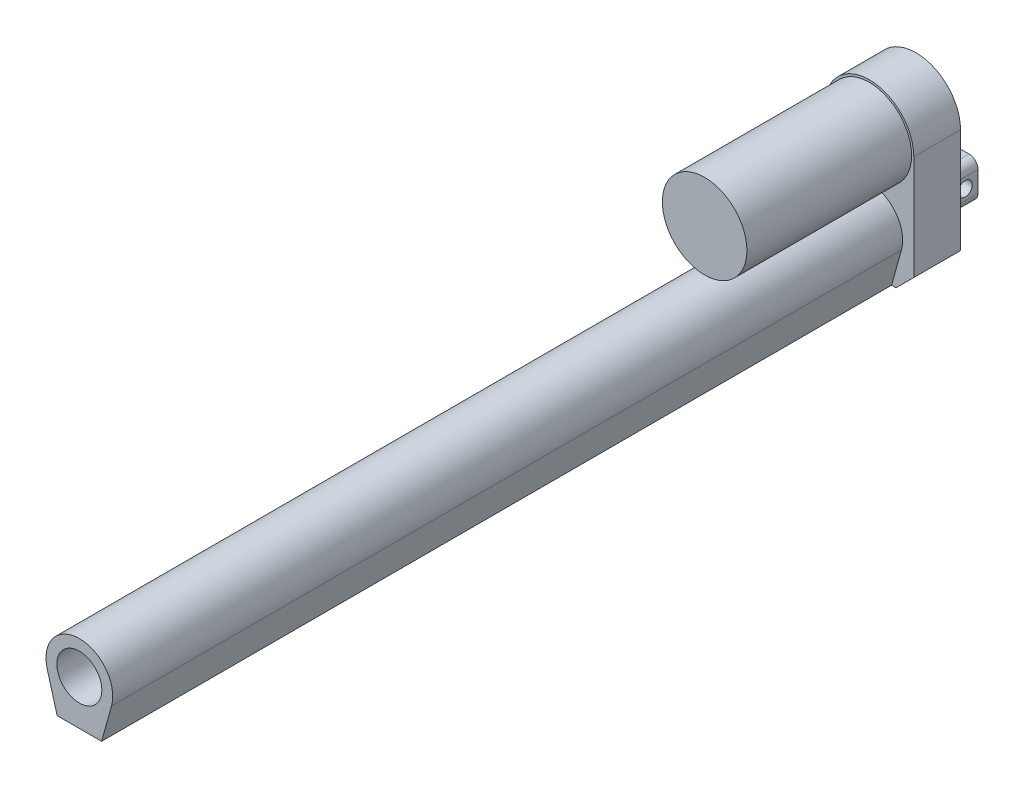
ISO-10303-21;
HEADER;
FILE_DESCRIPTION(('STEP AP214'),'2;1');
FILE_NAME('part.step','',(''),(''),'','','');
FILE_SCHEMA(('AUTOMOTIVE_DESIGN { 1 0 10303 214 1 1 1 1 }'));
ENDSEC;
DATA;
#1=APPLICATION_CONTEXT('core data for automotive mechanical design processes');
#2=APPLICATION_PROTOCOL_DEFINITION('international standard','automotive_design',2000,#1);
#3=PRODUCT_CONTEXT('',#1,'mechanical');
#4=PRODUCT('Part','Part','',(#3));
#5=PRODUCT_RELATED_PRODUCT_CATEGORY('part','',(#4));
#6=PRODUCT_DEFINITION_FORMATION('','',#4);
#7=PRODUCT_DEFINITION_CONTEXT('part definition',#1,'design');
#8=PRODUCT_DEFINITION('design','',#6,#7);
#9=PRODUCT_DEFINITION_SHAPE('','',#8);
#10=(LENGTH_UNIT() NAMED_UNIT(*) SI_UNIT(.MILLI.,.METRE.));
#11=(NAMED_UNIT(*) PLANE_ANGLE_UNIT() SI_UNIT($,.RADIAN.));
#12=(NAMED_UNIT(*) SI_UNIT($,.STERADIAN.) SOLID_ANGLE_UNIT());
#13=UNCERTAINTY_MEASURE_WITH_UNIT(LENGTH_MEASURE(1.E-05),#10,'distance_accuracy_value','');
#14=(GEOMETRIC_REPRESENTATION_CONTEXT(3) GLOBAL_UNCERTAINTY_ASSIGNED_CONTEXT((#13)) GLOBAL_UNIT_ASSIGNED_CONTEXT((#10,
#11,#12)) REPRESENTATION_CONTEXT('',''));
#15=CARTESIAN_POINT('',(0.,0.,0.));
#16=DIRECTION('',(0.,0.,1.));
#17=DIRECTION('',(1.,0.,0.));
#18=AXIS2_PLACEMENT_3D('',#15,#16,#17);
#19=CARTESIAN_POINT('',(0.,17.5,0.));
#20=DIRECTION('',(0.,0.,1.));
#21=DIRECTION('',(1.,0.,0.));
#22=AXIS2_PLACEMENT_3D('',#19,#20,#21);
#23=PLANE('',#22);
#24=DIRECTION('',(0.,-1.,0.));
#25=VECTOR('',#24,1.);
#26=CARTESIAN_POINT('',(-20.,-29.5,0.));
#27=LINE('',#26,#25);
#28=CARTESIAN_POINT('',(-20.,17.5,0.));
#29=VERTEX_POINT('',#28);
#30=CARTESIAN_POINT('',(-20.,-29.5,0.));
#31=VERTEX_POINT('',#30);
#32=EDGE_CURVE('E219',#29,#31,#27,.T.);
#33=ORIENTED_EDGE('',*,*,#32,.F.);
#34=CARTESIAN_POINT('',(0.,17.5,0.));
#35=DIRECTION('',(0.,0.,1.));
#36=DIRECTION('',(1.,0.,0.));
#37=AXIS2_PLACEMENT_3D('',#34,#35,#36);
#38=CIRCLE('',#37,20.);
#39=CARTESIAN_POINT('',(20.,17.5,0.));
#40=VERTEX_POINT('',#39);
#41=EDGE_CURVE('E225',#40,#29,#38,.T.);
#42=ORIENTED_EDGE('',*,*,#41,.F.);
#43=DIRECTION('',(0.,1.,0.));
#44=VECTOR('',#43,1.);
#45=CARTESIAN_POINT('',(20.,-29.5,0.));
#46=LINE('',#45,#44);
#47=CARTESIAN_POINT('',(20.,-29.5,0.));
#48=VERTEX_POINT('',#47);
#49=EDGE_CURVE('E246',#48,#40,#46,.T.);
#50=ORIENTED_EDGE('',*,*,#49,.F.);
#51=DIRECTION('',(0.707106781186546,0.707106781186549,0.));
#52=VECTOR('',#51,1.);
#53=CARTESIAN_POINT('',(12.,-37.5,0.));
#54=LINE('',#53,#52);
#55=CARTESIAN_POINT('',(12.,-37.5,0.));
#56=VERTEX_POINT('',#55);
#57=EDGE_CURVE('E244',#56,#48,#54,.T.);
#58=ORIENTED_EDGE('',*,*,#57,.F.);
#59=DIRECTION('',(1.,0.,0.));
#60=VECTOR('',#59,1.);
#61=CARTESIAN_POINT('',(-12.,-37.5,0.));
#62=LINE('',#61,#60);
#63=CARTESIAN_POINT('',(-12.,-37.5,0.));
#64=VERTEX_POINT('',#63);
#65=EDGE_CURVE('E242',#64,#56,#62,.T.);
#66=ORIENTED_EDGE('',*,*,#65,.F.);
#67=DIRECTION('',(0.707106781186546,-0.707106781186549,0.));
#68=VECTOR('',#67,1.);
#69=CARTESIAN_POINT('',(-12.,-37.5,0.));
#70=LINE('',#69,#68);
#71=EDGE_CURVE('E240',#31,#64,#70,.T.);
#72=ORIENTED_EDGE('',*,*,#71,.F.);
#73=EDGE_LOOP('',(#33,#42,#50,#58,#66,#72));
#74=FACE_BOUND('',#73,.T.);
#75=DIRECTION('',(0.,1.,0.));
#76=VECTOR('',#75,1.);
#77=CARTESIAN_POINT('',(-8.65000000000001,-26.5,0.));
#78=LINE('',#77,#76);
#79=CARTESIAN_POINT('',(-8.65000000000001,-22.5,0.));
#80=VERTEX_POINT('',#79);
#81=CARTESIAN_POINT('',(-8.65000000000001,-13.2,0.));
#82=VERTEX_POINT('',#81);
#83=EDGE_CURVE('E328',#80,#82,#78,.T.);
#84=ORIENTED_EDGE('',*,*,#83,.F.);
#85=CARTESIAN_POINT('',(-4.65000000000001,-22.5,0.));
#86=DIRECTION('',(0.,0.,1.));
#87=DIRECTION('',(1.,0.,0.));
#88=AXIS2_PLACEMENT_3D('',#85,#86,#87);
#89=CIRCLE('',#88,4.);
#90=CARTESIAN_POINT('',(-4.65000000000001,-26.5,0.));
#91=VERTEX_POINT('',#90);
#92=EDGE_CURVE('E11',#80,#91,#89,.T.);
#93=ORIENTED_EDGE('',*,*,#92,.T.);
#94=DIRECTION('',(-1.,0.,0.));
#95=VECTOR('',#94,1.);
#96=CARTESIAN_POINT('',(8.64999999999999,-26.5,0.));
#97=LINE('',#96,#95);
#98=CARTESIAN_POINT('',(4.64999999999999,-26.5,0.));
#99=VERTEX_POINT('',#98);
#100=EDGE_CURVE('E300',#99,#91,#97,.T.);
#101=ORIENTED_EDGE('',*,*,#100,.F.);
#102=CARTESIAN_POINT('',(4.64999999999999,-22.5,0.));
#103=DIRECTION('',(0.,0.,1.));
#104=DIRECTION('',(1.,0.,0.));
#105=AXIS2_PLACEMENT_3D('',#102,#103,#104);
#106=CIRCLE('',#105,4.);
#107=CARTESIAN_POINT('',(8.64999999999999,-22.5,0.));
#108=VERTEX_POINT('',#107);
#109=EDGE_CURVE('E60',#99,#108,#106,.T.);
#110=ORIENTED_EDGE('',*,*,#109,.T.);
#111=DIRECTION('',(0.,-1.,0.));
#112=VECTOR('',#111,1.);
#113=CARTESIAN_POINT('',(8.64999999999999,-26.5,0.));
#114=LINE('',#113,#112);
#115=CARTESIAN_POINT('',(8.64999999999999,-13.2,0.));
#116=VERTEX_POINT('',#115);
#117=EDGE_CURVE('E299',#116,#108,#114,.T.);
#118=ORIENTED_EDGE('',*,*,#117,.F.);
#119=CARTESIAN_POINT('',(4.64999999999999,-13.2,0.));
#120=DIRECTION('',(0.,0.,1.));
#121=DIRECTION('',(1.,0.,0.));
#122=AXIS2_PLACEMENT_3D('',#119,#120,#121);
#123=CIRCLE('',#122,4.);
#124=CARTESIAN_POINT('',(4.64999999999999,-9.19999999999999,0.));
#125=VERTEX_POINT('',#124);
#126=EDGE_CURVE('E295',#116,#125,#123,.T.);
#127=ORIENTED_EDGE('',*,*,#126,.T.);
#128=DIRECTION('',(1.,0.,0.));
#129=VECTOR('',#128,1.);
#130=CARTESIAN_POINT('',(8.64999999999999,-9.19999999999999,0.));
#131=LINE('',#130,#129);
#132=CARTESIAN_POINT('',(-4.65000000000001,-9.19999999999999,0.));
#133=VERTEX_POINT('',#132);
#134=EDGE_CURVE('E306',#133,#125,#131,.T.);
#135=ORIENTED_EDGE('',*,*,#134,.F.);
#136=CARTESIAN_POINT('',(-4.65000000000001,-13.2,0.));
#137=DIRECTION('',(0.,0.,1.));
#138=DIRECTION('',(1.,0.,0.));
#139=AXIS2_PLACEMENT_3D('',#136,#137,#138);
#140=CIRCLE('',#139,4.);
#141=EDGE_CURVE('E293',#133,#82,#140,.T.);
#142=ORIENTED_EDGE('',*,*,#141,.T.);
#143=EDGE_LOOP('',(#84,#93,#101,#110,#118,#127,#135,#142));
#144=FACE_BOUND('',#143,.T.);
#145=ADVANCED_FACE('F51',(#74,#144),#23,.F.);
#146=CARTESIAN_POINT('',(0.,17.5,21.));
#147=DIRECTION('',(0.,0.,1.));
#148=DIRECTION('',(1.,0.,0.));
#149=AXIS2_PLACEMENT_3D('',#146,#147,#148);
#150=PLANE('',#149);
#151=CARTESIAN_POINT('',(0.,17.5,21.));
#152=DIRECTION('',(0.,0.,1.));
#153=DIRECTION('',(1.,0.,0.));
#154=AXIS2_PLACEMENT_3D('',#151,#152,#153);
#155=CIRCLE('',#154,19.);
#156=CARTESIAN_POINT('',(19.,17.5,21.));
#157=VERTEX_POINT('',#156);
#158=EDGE_CURVE('E208',#157,#157,#155,.T.);
#159=ORIENTED_EDGE('',*,*,#158,.F.);
#160=EDGE_LOOP('',(#159));
#161=FACE_BOUND('',#160,.T.);
#162=DIRECTION('',(1.,0.,0.));
#163=VECTOR('',#162,1.);
#164=CARTESIAN_POINT('',(-12.,-37.5,21.));
#165=LINE('',#164,#163);
#166=CARTESIAN_POINT('',(-12.,-37.5,21.));
#167=VERTEX_POINT('',#166);
#168=CARTESIAN_POINT('',(-10.,-37.5,21.));
#169=VERTEX_POINT('',#168);
#170=EDGE_CURVE('E228',#167,#169,#165,.T.);
#171=ORIENTED_EDGE('',*,*,#170,.T.);
#172=DIRECTION('',(0.26833752096446,-0.96332495807108,0.));
#173=VECTOR('',#172,1.);
#174=CARTESIAN_POINT('',(-14.4498743710662,-21.5250628144669,21.));
#175=LINE('',#174,#173);
#176=CARTESIAN_POINT('',(-14.4498743710662,-21.5250628144669,21.));
#177=VERTEX_POINT('',#176);
#178=EDGE_CURVE('E322',#177,#169,#175,.T.);
#179=ORIENTED_EDGE('',*,*,#178,.F.);
#180=CARTESIAN_POINT('',(0.,-17.5,21.));
#181=DIRECTION('',(0.,0.,1.));
#182=DIRECTION('',(1.,0.,0.));
#183=AXIS2_PLACEMENT_3D('',#180,#181,#182);
#184=CIRCLE('',#183,15.);
#185=CARTESIAN_POINT('',(14.4498743710662,-21.5250628144669,21.));
#186=VERTEX_POINT('',#185);
#187=EDGE_CURVE('E205',#186,#177,#184,.T.);
#188=ORIENTED_EDGE('',*,*,#187,.F.);
#189=DIRECTION('',(0.26833752096446,0.96332495807108,0.));
#190=VECTOR('',#189,1.);
#191=CARTESIAN_POINT('',(14.4498743710662,-21.5250628144669,21.));
#192=LINE('',#191,#190);
#193=CARTESIAN_POINT('',(10.,-37.5,21.));
#194=VERTEX_POINT('',#193);
#195=EDGE_CURVE('E201',#194,#186,#192,.T.);
#196=ORIENTED_EDGE('',*,*,#195,.F.);
#197=CARTESIAN_POINT('',(12.,-37.5,21.));
#198=VERTEX_POINT('',#197);
#199=EDGE_CURVE('E227',#194,#198,#165,.T.);
#200=ORIENTED_EDGE('',*,*,#199,.T.);
#201=DIRECTION('',(0.707106781186546,0.707106781186549,0.));
#202=VECTOR('',#201,1.);
#203=CARTESIAN_POINT('',(12.,-37.5,21.));
#204=LINE('',#203,#202);
#205=CARTESIAN_POINT('',(20.,-29.5,21.));
#206=VERTEX_POINT('',#205);
#207=EDGE_CURVE('E231',#198,#206,#204,.T.);
#208=ORIENTED_EDGE('',*,*,#207,.T.);
#209=DIRECTION('',(0.,1.,0.));
#210=VECTOR('',#209,1.);
#211=CARTESIAN_POINT('',(20.,-29.5,21.));
#212=LINE('',#211,#210);
#213=CARTESIAN_POINT('',(20.,17.5,21.));
#214=VERTEX_POINT('',#213);
#215=EDGE_CURVE('E233',#206,#214,#212,.T.);
#216=ORIENTED_EDGE('',*,*,#215,.T.);
#217=CARTESIAN_POINT('',(0.,17.5,21.));
#218=DIRECTION('',(0.,0.,1.));
#219=DIRECTION('',(1.,0.,0.));
#220=AXIS2_PLACEMENT_3D('',#217,#218,#219);
#221=CIRCLE('',#220,20.);
#222=CARTESIAN_POINT('',(-20.,17.5,21.));
#223=VERTEX_POINT('',#222);
#224=EDGE_CURVE('E235',#214,#223,#221,.T.);
#225=ORIENTED_EDGE('',*,*,#224,.T.);
#226=DIRECTION('',(0.,-1.,0.));
#227=VECTOR('',#226,1.);
#228=CARTESIAN_POINT('',(-20.,-29.5,21.));
#229=LINE('',#228,#227);
#230=CARTESIAN_POINT('',(-20.,-29.5,21.));
#231=VERTEX_POINT('',#230);
#232=EDGE_CURVE('E221',#223,#231,#229,.T.);
#233=ORIENTED_EDGE('',*,*,#232,.T.);
#234=DIRECTION('',(0.707106781186546,-0.707106781186549,0.));
#235=VECTOR('',#234,1.);
#236=CARTESIAN_POINT('',(-12.,-37.5,21.));
#237=LINE('',#236,#235);
#238=EDGE_CURVE('E224',#231,#167,#237,.T.);
#239=ORIENTED_EDGE('',*,*,#238,.T.);
#240=EDGE_LOOP('',(#171,#179,#188,#196,#200,#208,#216,#225,#233,#239));
#241=FACE_BOUND('',#240,.T.);
#242=ADVANCED_FACE('F353',(#161,#241),#150,.T.);
#243=CARTESIAN_POINT('',(-20.,-29.5,21.));
#244=DIRECTION('',(1.,0.,0.));
#245=DIRECTION('',(0.,1.,0.));
#246=AXIS2_PLACEMENT_3D('',#243,#244,#245);
#247=PLANE('',#246);
#248=ORIENTED_EDGE('',*,*,#32,.T.);
#249=DIRECTION('',(0.,0.,-1.));
#250=VECTOR('',#249,1.);
#251=CARTESIAN_POINT('',(-20.,-29.5,21.));
#252=LINE('',#251,#250);
#253=EDGE_CURVE('E263',#231,#31,#252,.T.);
#254=ORIENTED_EDGE('',*,*,#253,.F.);
#255=ORIENTED_EDGE('',*,*,#232,.F.);
#256=DIRECTION('',(0.,0.,-1.));
#257=VECTOR('',#256,1.);
#258=CARTESIAN_POINT('',(-20.,17.5,21.));
#259=LINE('',#258,#257);
#260=EDGE_CURVE('E237',#223,#29,#259,.T.);
#261=ORIENTED_EDGE('',*,*,#260,.T.);
#262=EDGE_LOOP('',(#248,#254,#255,#261));
#263=FACE_BOUND('',#262,.T.);
#264=ADVANCED_FACE('F376',(#263),#247,.F.);
#265=CARTESIAN_POINT('',(-12.,-37.5,21.));
#266=DIRECTION('',(0.707106781186549,0.707106781186546,0.));
#267=DIRECTION('',(-0.707106781186546,0.707106781186549,0.));
#268=AXIS2_PLACEMENT_3D('',#265,#266,#267);
#269=PLANE('',#268);
#270=ORIENTED_EDGE('',*,*,#71,.T.);
#271=DIRECTION('',(0.,0.,-1.));
#272=VECTOR('',#271,1.);
#273=CARTESIAN_POINT('',(-12.,-37.5,21.));
#274=LINE('',#273,#272);
#275=EDGE_CURVE('E260',#167,#64,#274,.T.);
#276=ORIENTED_EDGE('',*,*,#275,.F.);
#277=ORIENTED_EDGE('',*,*,#238,.F.);
#278=ORIENTED_EDGE('',*,*,#253,.T.);
#279=EDGE_LOOP('',(#270,#276,#277,#278));
#280=FACE_BOUND('',#279,.T.);
#281=ADVANCED_FACE('F380',(#280),#269,.F.);
#282=CARTESIAN_POINT('',(-12.,-37.5,21.));
#283=DIRECTION('',(0.,1.,0.));
#284=DIRECTION('',(0.,0.,1.));
#285=AXIS2_PLACEMENT_3D('',#282,#283,#284);
#286=PLANE('',#285);
#287=ORIENTED_EDGE('',*,*,#65,.T.);
#288=DIRECTION('',(0.,0.,-1.));
#289=VECTOR('',#288,1.);
#290=CARTESIAN_POINT('',(12.,-37.5,21.));
#291=LINE('',#290,#289);
#292=EDGE_CURVE('E257',#198,#56,#291,.T.);
#293=ORIENTED_EDGE('',*,*,#292,.F.);
#294=ORIENTED_EDGE('',*,*,#199,.F.);
#295=DIRECTION('',(0.,0.,-1.));
#296=VECTOR('',#295,1.);
#297=CARTESIAN_POINT('',(10.,-37.5,376.));
#298=LINE('',#297,#296);
#299=CARTESIAN_POINT('',(10.,-37.5,376.));
#300=VERTEX_POINT('',#299);
#301=EDGE_CURVE('E214',#300,#194,#298,.T.);
#302=ORIENTED_EDGE('',*,*,#301,.F.);
#303=DIRECTION('',(1.,0.,0.));
#304=VECTOR('',#303,1.);
#305=CARTESIAN_POINT('',(-10.,-37.5,376.));
#306=LINE('',#305,#304);
#307=CARTESIAN_POINT('',(-10.,-37.5,376.));
#308=VERTEX_POINT('',#307);
#309=EDGE_CURVE('E190',#308,#300,#306,.T.);
#310=ORIENTED_EDGE('',*,*,#309,.F.);
#311=DIRECTION('',(0.,0.,-1.));
#312=VECTOR('',#311,1.);
#313=CARTESIAN_POINT('',(-10.,-37.5,376.));
#314=LINE('',#313,#312);
#315=EDGE_CURVE('E186',#308,#169,#314,.T.);
#316=ORIENTED_EDGE('',*,*,#315,.T.);
#317=ORIENTED_EDGE('',*,*,#170,.F.);
#318=ORIENTED_EDGE('',*,*,#275,.T.);
#319=EDGE_LOOP('',(#287,#293,#294,#302,#310,#316,#317,#318));
#320=FACE_BOUND('',#319,.T.);
#321=ADVANCED_FACE('F355',(#320),#286,.F.);
#322=CARTESIAN_POINT('',(12.,-37.5,21.));
#323=DIRECTION('',(-0.707106781186549,0.707106781186546,0.));
#324=DIRECTION('',(-0.707106781186546,-0.707106781186549,0.));
#325=AXIS2_PLACEMENT_3D('',#322,#323,#324);
#326=PLANE('',#325);
#327=ORIENTED_EDGE('',*,*,#57,.T.);
#328=DIRECTION('',(0.,0.,-1.));
#329=VECTOR('',#328,1.);
#330=CARTESIAN_POINT('',(20.,-29.5,21.));
#331=LINE('',#330,#329);
#332=EDGE_CURVE('E254',#206,#48,#331,.T.);
#333=ORIENTED_EDGE('',*,*,#332,.F.);
#334=ORIENTED_EDGE('',*,*,#207,.F.);
#335=ORIENTED_EDGE('',*,*,#292,.T.);
#336=EDGE_LOOP('',(#327,#333,#334,#335));
#337=FACE_BOUND('',#336,.T.);
#338=ADVANCED_FACE('F361',(#337),#326,.F.);
#339=CARTESIAN_POINT('',(20.,-29.5,21.));
#340=DIRECTION('',(-1.,0.,0.));
#341=DIRECTION('',(0.,-1.,0.));
#342=AXIS2_PLACEMENT_3D('',#339,#340,#341);
#343=PLANE('',#342);
#344=ORIENTED_EDGE('',*,*,#49,.T.);
#345=DIRECTION('',(0.,0.,-1.));
#346=VECTOR('',#345,1.);
#347=CARTESIAN_POINT('',(20.,17.5,21.));
#348=LINE('',#347,#346);
#349=EDGE_CURVE('E251',#214,#40,#348,.T.);
#350=ORIENTED_EDGE('',*,*,#349,.F.);
#351=ORIENTED_EDGE('',*,*,#215,.F.);
#352=ORIENTED_EDGE('',*,*,#332,.T.);
#353=EDGE_LOOP('',(#344,#350,#351,#352));
#354=FACE_BOUND('',#353,.T.);
#355=ADVANCED_FACE('F367',(#354),#343,.F.);
#356=CARTESIAN_POINT('',(0.,17.5,21.));
#357=DIRECTION('',(0.,0.,-1.));
#358=DIRECTION('',(-1.,0.,0.));
#359=AXIS2_PLACEMENT_3D('',#356,#357,#358);
#360=CYLINDRICAL_SURFACE('',#359,20.);
#361=ORIENTED_EDGE('',*,*,#41,.T.);
#362=ORIENTED_EDGE('',*,*,#260,.F.);
#363=ORIENTED_EDGE('',*,*,#224,.F.);
#364=ORIENTED_EDGE('',*,*,#349,.T.);
#365=EDGE_LOOP('',(#361,#362,#363,#364));
#366=FACE_BOUND('',#365,.T.);
#367=ADVANCED_FACE('F371',(#366),#360,.T.);
#368=CARTESIAN_POINT('',(0.,17.5,95.));
#369=DIRECTION('',(0.,0.,-1.));
#370=DIRECTION('',(-1.,0.,0.));
#371=AXIS2_PLACEMENT_3D('',#368,#369,#370);
#372=CYLINDRICAL_SURFACE('',#371,19.);
#373=CARTESIAN_POINT('',(0.,17.5,95.));
#374=DIRECTION('',(0.,0.,1.));
#375=DIRECTION('',(1.,0.,0.));
#376=AXIS2_PLACEMENT_3D('',#373,#374,#375);
#377=CIRCLE('',#376,19.);
#378=CARTESIAN_POINT('',(19.,17.5,95.));
#379=VERTEX_POINT('',#378);
#380=EDGE_CURVE('E211',#379,#379,#377,.T.);
#381=ORIENTED_EDGE('',*,*,#380,.F.);
#382=EDGE_LOOP('',(#381));
#383=FACE_BOUND('',#382,.T.);
#384=ORIENTED_EDGE('',*,*,#158,.T.);
#385=EDGE_LOOP('',(#384));
#386=FACE_BOUND('',#385,.T.);
#387=ADVANCED_FACE('F395',(#383,#386),#372,.T.);
#388=CARTESIAN_POINT('',(0.,17.5,95.));
#389=DIRECTION('',(0.,0.,1.));
#390=DIRECTION('',(1.,0.,0.));
#391=AXIS2_PLACEMENT_3D('',#388,#389,#390);
#392=PLANE('',#391);
#393=ORIENTED_EDGE('',*,*,#380,.T.);
#394=EDGE_LOOP('',(#393));
#395=FACE_BOUND('',#394,.T.);
#396=ADVANCED_FACE('F477',(#395),#392,.T.);
#397=CARTESIAN_POINT('',(0.,-17.5,376.));
#398=DIRECTION('',(0.,0.,-1.));
#399=DIRECTION('',(-1.,0.,0.));
#400=AXIS2_PLACEMENT_3D('',#397,#398,#399);
#401=CYLINDRICAL_SURFACE('',#400,15.);
#402=ORIENTED_EDGE('',*,*,#187,.T.);
#403=DIRECTION('',(0.,0.,-1.));
#404=VECTOR('',#403,1.);
#405=CARTESIAN_POINT('',(-14.4498743710662,-21.5250628144669,376.));
#406=LINE('',#405,#404);
#407=CARTESIAN_POINT('',(-14.4498743710662,-21.5250628144669,376.));
#408=VERTEX_POINT('',#407);
#409=EDGE_CURVE('E183',#408,#177,#406,.T.);
#410=ORIENTED_EDGE('',*,*,#409,.F.);
#411=CARTESIAN_POINT('',(0.,-17.5,376.));
#412=DIRECTION('',(0.,0.,1.));
#413=DIRECTION('',(1.,0.,0.));
#414=AXIS2_PLACEMENT_3D('',#411,#412,#413);
#415=CIRCLE('',#414,15.);
#416=CARTESIAN_POINT('',(14.4498743710662,-21.5250628144669,376.));
#417=VERTEX_POINT('',#416);
#418=EDGE_CURVE('E191',#417,#408,#415,.T.);
#419=ORIENTED_EDGE('',*,*,#418,.F.);
#420=DIRECTION('',(0.,0.,-1.));
#421=VECTOR('',#420,1.);
#422=CARTESIAN_POINT('',(14.4498743710662,-21.5250628144669,376.));
#423=LINE('',#422,#421);
#424=EDGE_CURVE('E339',#417,#186,#423,.T.);
#425=ORIENTED_EDGE('',*,*,#424,.T.);
#426=EDGE_LOOP('',(#402,#410,#419,#425));
#427=FACE_BOUND('',#426,.T.);
#428=ADVANCED_FACE('F203',(#427),#401,.T.);
#429=CARTESIAN_POINT('',(-14.4498743710662,-21.5250628144669,376.));
#430=DIRECTION('',(0.96332495807108,0.26833752096446,0.));
#431=DIRECTION('',(-0.26833752096446,0.96332495807108,0.));
#432=AXIS2_PLACEMENT_3D('',#429,#430,#431);
#433=PLANE('',#432);
#434=ORIENTED_EDGE('',*,*,#178,.T.);
#435=ORIENTED_EDGE('',*,*,#315,.F.);
#436=DIRECTION('',(0.26833752096446,-0.96332495807108,0.));
#437=VECTOR('',#436,1.);
#438=CARTESIAN_POINT('',(-14.4498743710662,-21.5250628144669,376.));
#439=LINE('',#438,#437);
#440=EDGE_CURVE('E179',#408,#308,#439,.T.);
#441=ORIENTED_EDGE('',*,*,#440,.F.);
#442=ORIENTED_EDGE('',*,*,#409,.T.);
#443=EDGE_LOOP('',(#434,#435,#441,#442));
#444=FACE_BOUND('',#443,.T.);
#445=ADVANCED_FACE('F181',(#444),#433,.F.);
#446=CARTESIAN_POINT('',(14.4498743710662,-21.5250628144669,376.));
#447=DIRECTION('',(-0.96332495807108,0.26833752096446,0.));
#448=DIRECTION('',(-0.26833752096446,-0.96332495807108,0.));
#449=AXIS2_PLACEMENT_3D('',#446,#447,#448);
#450=PLANE('',#449);
#451=ORIENTED_EDGE('',*,*,#195,.T.);
#452=ORIENTED_EDGE('',*,*,#424,.F.);
#453=DIRECTION('',(0.26833752096446,0.96332495807108,0.));
#454=VECTOR('',#453,1.);
#455=CARTESIAN_POINT('',(14.4498743710662,-21.5250628144669,376.));
#456=LINE('',#455,#454);
#457=EDGE_CURVE('E196',#300,#417,#456,.T.);
#458=ORIENTED_EDGE('',*,*,#457,.F.);
#459=ORIENTED_EDGE('',*,*,#301,.T.);
#460=EDGE_LOOP('',(#451,#452,#458,#459));
#461=FACE_BOUND('',#460,.T.);
#462=ADVANCED_FACE('F349',(#461),#450,.F.);
#463=CARTESIAN_POINT('',(0.,-17.5,376.));
#464=DIRECTION('',(0.,0.,1.));
#465=DIRECTION('',(1.,0.,0.));
#466=AXIS2_PLACEMENT_3D('',#463,#464,#465);
#467=PLANE('',#466);
#468=CARTESIAN_POINT('',(0.,-17.5,376.));
#469=DIRECTION('',(0.,0.,1.));
#470=DIRECTION('',(1.,0.,0.));
#471=AXIS2_PLACEMENT_3D('',#468,#469,#470);
#472=CIRCLE('',#471,10.1);
#473=CARTESIAN_POINT('',(10.1,-17.5,376.));
#474=VERTEX_POINT('',#473);
#475=EDGE_CURVE('E435',#474,#474,#472,.T.);
#476=ORIENTED_EDGE('',*,*,#475,.F.);
#477=EDGE_LOOP('',(#476));
#478=FACE_BOUND('',#477,.T.);
#479=ORIENTED_EDGE('',*,*,#418,.T.);
#480=ORIENTED_EDGE('',*,*,#440,.T.);
#481=ORIENTED_EDGE('',*,*,#309,.T.);
#482=ORIENTED_EDGE('',*,*,#457,.T.);
#483=EDGE_LOOP('',(#479,#480,#481,#482));
#484=FACE_BOUND('',#483,.T.);
#485=ADVANCED_FACE('F194',(#478,#484),#467,.T.);
#486=CARTESIAN_POINT('',(-8.65000000000001,-26.5,-19.2));
#487=DIRECTION('',(1.,0.,0.));
#488=DIRECTION('',(0.,0.,-1.));
#489=AXIS2_PLACEMENT_3D('',#486,#487,#488);
#490=PLANE('',#489);
#491=CARTESIAN_POINT('',(-8.65000000000001,-17.85,-13.45));
#492=DIRECTION('',(1.,0.,0.));
#493=DIRECTION('',(0.,0.,-1.));
#494=AXIS2_PLACEMENT_3D('',#491,#492,#493);
#495=CIRCLE('',#494,3.175);
#496=CARTESIAN_POINT('',(-8.65000000000001,-17.85,-16.625));
#497=VERTEX_POINT('',#496);
#498=EDGE_CURVE('E438',#497,#497,#495,.T.);
#499=ORIENTED_EDGE('',*,*,#498,.T.);
#500=EDGE_LOOP('',(#499));
#501=FACE_BOUND('',#500,.T.);
#502=ORIENTED_EDGE('',*,*,#83,.T.);
#503=DIRECTION('',(0.,0.,1.));
#504=VECTOR('',#503,1.);
#505=CARTESIAN_POINT('',(-8.65000000000001,-13.2,-19.2));
#506=LINE('',#505,#504);
#507=CARTESIAN_POINT('',(-8.65000000000001,-13.2,-19.2));
#508=VERTEX_POINT('',#507);
#509=EDGE_CURVE('E274',#82,#508,#506,.F.);
#510=ORIENTED_EDGE('',*,*,#509,.T.);
#511=DIRECTION('',(0.,1.,0.));
#512=VECTOR('',#511,1.);
#513=CARTESIAN_POINT('',(-8.65000000000001,-26.5,-19.2));
#514=LINE('',#513,#512);
#515=CARTESIAN_POINT('',(-8.65000000000001,-22.5,-19.2));
#516=VERTEX_POINT('',#515);
#517=EDGE_CURVE('E334',#516,#508,#514,.T.);
#518=ORIENTED_EDGE('',*,*,#517,.F.);
#519=DIRECTION('',(0.,0.,1.));
#520=VECTOR('',#519,1.);
#521=CARTESIAN_POINT('',(-8.65000000000001,-22.5,-19.2));
#522=LINE('',#521,#520);
#523=EDGE_CURVE('E271',#516,#80,#522,.T.);
#524=ORIENTED_EDGE('',*,*,#523,.T.);
#525=EDGE_LOOP('',(#502,#510,#518,#524));
#526=FACE_BOUND('',#525,.T.);
#527=ADVANCED_FACE('F430',(#501,#526),#490,.F.);
#528=CARTESIAN_POINT('',(8.64999999999999,-9.19999999999999,-19.2));
#529=DIRECTION('',(0.,-1.,0.));
#530=DIRECTION('',(0.,0.,-1.));
#531=AXIS2_PLACEMENT_3D('',#528,#529,#530);
#532=PLANE('',#531);
#533=DIRECTION('',(1.,0.,0.));
#534=VECTOR('',#533,1.);
#535=CARTESIAN_POINT('',(8.64999999999999,-9.19999999999999,-19.2));
#536=LINE('',#535,#534);
#537=CARTESIAN_POINT('',(-4.65000000000001,-9.19999999999999,-19.2));
#538=VERTEX_POINT('',#537);
#539=CARTESIAN_POINT('',(4.64999999999999,-9.19999999999999,-19.2));
#540=VERTEX_POINT('',#539);
#541=EDGE_CURVE('E324',#538,#540,#536,.T.);
#542=ORIENTED_EDGE('',*,*,#541,.F.);
#543=DIRECTION('',(0.,0.,1.));
#544=VECTOR('',#543,1.);
#545=CARTESIAN_POINT('',(-4.65000000000001,-9.19999999999999,-19.2));
#546=LINE('',#545,#544);
#547=EDGE_CURVE('E268',#538,#133,#546,.T.);
#548=ORIENTED_EDGE('',*,*,#547,.T.);
#549=ORIENTED_EDGE('',*,*,#134,.T.);
#550=DIRECTION('',(0.,0.,1.));
#551=VECTOR('',#550,1.);
#552=CARTESIAN_POINT('',(4.64999999999999,-9.19999999999999,-19.2));
#553=LINE('',#552,#551);
#554=EDGE_CURVE('E266',#125,#540,#553,.F.);
#555=ORIENTED_EDGE('',*,*,#554,.T.);
#556=EDGE_LOOP('',(#542,#548,#549,#555));
#557=FACE_BOUND('',#556,.T.);
#558=ADVANCED_FACE('F464',(#557),#532,.F.);
#559=CARTESIAN_POINT('',(8.64999999999999,-26.5,-19.2));
#560=DIRECTION('',(-1.,0.,0.));
#561=DIRECTION('',(0.,0.,1.));
#562=AXIS2_PLACEMENT_3D('',#559,#560,#561);
#563=PLANE('',#562);
#564=CARTESIAN_POINT('',(8.64999999999999,-17.85,-13.45));
#565=DIRECTION('',(-1.,0.,0.));
#566=DIRECTION('',(0.,0.,1.));
#567=AXIS2_PLACEMENT_3D('',#564,#565,#566);
#568=CIRCLE('',#567,3.175);
#569=CARTESIAN_POINT('',(8.64999999999999,-17.85,-10.275));
#570=VERTEX_POINT('',#569);
#571=EDGE_CURVE('E55',#570,#570,#568,.T.);
#572=ORIENTED_EDGE('',*,*,#571,.T.);
#573=EDGE_LOOP('',(#572));
#574=FACE_BOUND('',#573,.T.);
#575=DIRECTION('',(0.,-1.,0.));
#576=VECTOR('',#575,1.);
#577=CARTESIAN_POINT('',(8.64999999999999,-26.5,-19.2));
#578=LINE('',#577,#576);
#579=CARTESIAN_POINT('',(8.64999999999999,-13.2,-19.2));
#580=VERTEX_POINT('',#579);
#581=CARTESIAN_POINT('',(8.64999999999999,-22.5,-19.2));
#582=VERTEX_POINT('',#581);
#583=EDGE_CURVE('E317',#580,#582,#578,.T.);
#584=ORIENTED_EDGE('',*,*,#583,.F.);
#585=DIRECTION('',(0.,0.,1.));
#586=VECTOR('',#585,1.);
#587=CARTESIAN_POINT('',(8.64999999999999,-13.2,-19.2));
#588=LINE('',#587,#586);
#589=EDGE_CURVE('E286',#580,#116,#588,.T.);
#590=ORIENTED_EDGE('',*,*,#589,.T.);
#591=ORIENTED_EDGE('',*,*,#117,.T.);
#592=DIRECTION('',(0.,0.,1.));
#593=VECTOR('',#592,1.);
#594=CARTESIAN_POINT('',(8.64999999999999,-22.5,-19.2));
#595=LINE('',#594,#593);
#596=EDGE_CURVE('E284',#108,#582,#595,.F.);
#597=ORIENTED_EDGE('',*,*,#596,.T.);
#598=EDGE_LOOP('',(#584,#590,#591,#597));
#599=FACE_BOUND('',#598,.T.);
#600=ADVANCED_FACE('F303',(#574,#599),#563,.F.);
#601=CARTESIAN_POINT('',(8.64999999999999,-26.5,-19.2));
#602=DIRECTION('',(0.,1.,0.));
#603=DIRECTION('',(0.,0.,1.));
#604=AXIS2_PLACEMENT_3D('',#601,#602,#603);
#605=PLANE('',#604);
#606=DIRECTION('',(-1.,0.,0.));
#607=VECTOR('',#606,1.);
#608=CARTESIAN_POINT('',(8.64999999999999,-26.5,-19.2));
#609=LINE('',#608,#607);
#610=CARTESIAN_POINT('',(4.64999999999999,-26.5,-19.2));
#611=VERTEX_POINT('',#610);
#612=CARTESIAN_POINT('',(-4.65000000000001,-26.5,-19.2));
#613=VERTEX_POINT('',#612);
#614=EDGE_CURVE('E315',#611,#613,#609,.T.);
#615=ORIENTED_EDGE('',*,*,#614,.F.);
#616=DIRECTION('',(0.,0.,1.));
#617=VECTOR('',#616,1.);
#618=CARTESIAN_POINT('',(4.64999999999999,-26.5,-19.2));
#619=LINE('',#618,#617);
#620=EDGE_CURVE('E291',#611,#99,#619,.T.);
#621=ORIENTED_EDGE('',*,*,#620,.T.);
#622=ORIENTED_EDGE('',*,*,#100,.T.);
#623=DIRECTION('',(0.,0.,1.));
#624=VECTOR('',#623,1.);
#625=CARTESIAN_POINT('',(-4.65000000000001,-26.5,-19.2));
#626=LINE('',#625,#624);
#627=EDGE_CURVE('E289',#91,#613,#626,.F.);
#628=ORIENTED_EDGE('',*,*,#627,.T.);
#629=EDGE_LOOP('',(#615,#621,#622,#628));
#630=FACE_BOUND('',#629,.T.);
#631=ADVANCED_FACE('F319',(#630),#605,.F.);
#632=CARTESIAN_POINT('',(0.,0.,-19.2));
#633=DIRECTION('',(0.,0.,1.));
#634=DIRECTION('',(1.,0.,0.));
#635=AXIS2_PLACEMENT_3D('',#632,#633,#634);
#636=PLANE('',#635);
#637=ORIENTED_EDGE('',*,*,#517,.T.);
#638=CARTESIAN_POINT('',(-4.65000000000001,-13.2,-19.2));
#639=DIRECTION('',(0.,0.,1.));
#640=DIRECTION('',(1.,0.,0.));
#641=AXIS2_PLACEMENT_3D('',#638,#639,#640);
#642=CIRCLE('',#641,4.);
#643=EDGE_CURVE('E282',#508,#538,#642,.F.);
#644=ORIENTED_EDGE('',*,*,#643,.T.);
#645=ORIENTED_EDGE('',*,*,#541,.T.);
#646=CARTESIAN_POINT('',(4.64999999999999,-13.2,-19.2));
#647=DIRECTION('',(0.,0.,1.));
#648=DIRECTION('',(1.,0.,0.));
#649=AXIS2_PLACEMENT_3D('',#646,#647,#648);
#650=CIRCLE('',#649,4.);
#651=EDGE_CURVE('E280',#540,#580,#650,.F.);
#652=ORIENTED_EDGE('',*,*,#651,.T.);
#653=ORIENTED_EDGE('',*,*,#583,.T.);
#654=CARTESIAN_POINT('',(4.64999999999999,-22.5,-19.2));
#655=DIRECTION('',(0.,0.,1.));
#656=DIRECTION('',(1.,0.,0.));
#657=AXIS2_PLACEMENT_3D('',#654,#655,#656);
#658=CIRCLE('',#657,4.);
#659=EDGE_CURVE('E278',#582,#611,#658,.F.);
#660=ORIENTED_EDGE('',*,*,#659,.T.);
#661=ORIENTED_EDGE('',*,*,#614,.T.);
#662=CARTESIAN_POINT('',(-4.65000000000001,-22.5,-19.2));
#663=DIRECTION('',(0.,0.,1.));
#664=DIRECTION('',(1.,0.,0.));
#665=AXIS2_PLACEMENT_3D('',#662,#663,#664);
#666=CIRCLE('',#665,4.);
#667=EDGE_CURVE('E276',#613,#516,#666,.F.);
#668=ORIENTED_EDGE('',*,*,#667,.T.);
#669=EDGE_LOOP('',(#637,#644,#645,#652,#653,#660,#661,#668));
#670=FACE_BOUND('',#669,.T.);
#671=ADVANCED_FACE('F314',(#670),#636,.F.);
#672=CARTESIAN_POINT('',(-4.65000000000001,-13.2,-19.2));
#673=DIRECTION('',(0.,0.,1.));
#674=DIRECTION('',(1.,0.,0.));
#675=AXIS2_PLACEMENT_3D('',#672,#673,#674);
#676=CYLINDRICAL_SURFACE('',#675,4.);
#677=ORIENTED_EDGE('',*,*,#643,.F.);
#678=ORIENTED_EDGE('',*,*,#509,.F.);
#679=ORIENTED_EDGE('',*,*,#141,.F.);
#680=ORIENTED_EDGE('',*,*,#547,.F.);
#681=EDGE_LOOP('',(#677,#678,#679,#680));
#682=FACE_BOUND('',#681,.T.);
#683=ADVANCED_FACE('F406',(#682),#676,.T.);
#684=CARTESIAN_POINT('',(4.64999999999999,-13.2,-19.2));
#685=DIRECTION('',(0.,0.,1.));
#686=DIRECTION('',(1.,0.,0.));
#687=AXIS2_PLACEMENT_3D('',#684,#685,#686);
#688=CYLINDRICAL_SURFACE('',#687,4.);
#689=ORIENTED_EDGE('',*,*,#651,.F.);
#690=ORIENTED_EDGE('',*,*,#554,.F.);
#691=ORIENTED_EDGE('',*,*,#126,.F.);
#692=ORIENTED_EDGE('',*,*,#589,.F.);
#693=EDGE_LOOP('',(#689,#690,#691,#692));
#694=FACE_BOUND('',#693,.T.);
#695=ADVANCED_FACE('F409',(#694),#688,.T.);
#696=CARTESIAN_POINT('',(4.64999999999999,-22.5,-19.2));
#697=DIRECTION('',(0.,0.,1.));
#698=DIRECTION('',(1.,0.,0.));
#699=AXIS2_PLACEMENT_3D('',#696,#697,#698);
#700=CYLINDRICAL_SURFACE('',#699,4.);
#701=ORIENTED_EDGE('',*,*,#659,.F.);
#702=ORIENTED_EDGE('',*,*,#596,.F.);
#703=ORIENTED_EDGE('',*,*,#109,.F.);
#704=ORIENTED_EDGE('',*,*,#620,.F.);
#705=EDGE_LOOP('',(#701,#702,#703,#704));
#706=FACE_BOUND('',#705,.T.);
#707=ADVANCED_FACE('F309',(#706),#700,.T.);
#708=CARTESIAN_POINT('',(-4.65000000000001,-22.5,-19.2));
#709=DIRECTION('',(0.,0.,1.));
#710=DIRECTION('',(1.,0.,0.));
#711=AXIS2_PLACEMENT_3D('',#708,#709,#710);
#712=CYLINDRICAL_SURFACE('',#711,4.);
#713=ORIENTED_EDGE('',*,*,#667,.F.);
#714=ORIENTED_EDGE('',*,*,#627,.F.);
#715=ORIENTED_EDGE('',*,*,#92,.F.);
#716=ORIENTED_EDGE('',*,*,#523,.F.);
#717=EDGE_LOOP('',(#713,#714,#715,#716));
#718=FACE_BOUND('',#717,.T.);
#719=ADVANCED_FACE('F53',(#718),#712,.T.);
#720=CARTESIAN_POINT('',(0.,-17.5,76.));
#721=DIRECTION('',(0.,0.,1.));
#722=DIRECTION('',(1.,0.,0.));
#723=AXIS2_PLACEMENT_3D('',#720,#721,#722);
#724=CYLINDRICAL_SURFACE('',#723,10.1);
#725=CARTESIAN_POINT('',(0.,-17.5,76.));
#726=DIRECTION('',(0.,0.,1.));
#727=DIRECTION('',(1.,0.,0.));
#728=AXIS2_PLACEMENT_3D('',#725,#726,#727);
#729=CIRCLE('',#728,10.1);
#730=CARTESIAN_POINT('',(10.1,-17.5,76.));
#731=VERTEX_POINT('',#730);
#732=EDGE_CURVE('E331',#731,#731,#729,.T.);
#733=ORIENTED_EDGE('',*,*,#732,.F.);
#734=EDGE_LOOP('',(#733));
#735=FACE_BOUND('',#734,.T.);
#736=ORIENTED_EDGE('',*,*,#475,.T.);
#737=EDGE_LOOP('',(#736));
#738=FACE_BOUND('',#737,.T.);
#739=ADVANCED_FACE('F417',(#735,#738),#724,.F.);
#740=CARTESIAN_POINT('',(0.,-17.5,76.));
#741=DIRECTION('',(0.,0.,1.));
#742=DIRECTION('',(1.,0.,0.));
#743=AXIS2_PLACEMENT_3D('',#740,#741,#742);
#744=PLANE('',#743);
#745=ORIENTED_EDGE('',*,*,#732,.T.);
#746=EDGE_LOOP('',(#745));
#747=FACE_BOUND('',#746,.T.);
#748=ADVANCED_FACE('F423',(#747),#744,.T.);
#749=CARTESIAN_POINT('',(-20.,-17.85,-13.45));
#750=DIRECTION('',(1.,0.,0.));
#751=DIRECTION('',(0.,0.,-1.));
#752=AXIS2_PLACEMENT_3D('',#749,#750,#751);
#753=CYLINDRICAL_SURFACE('',#752,3.175);
#754=ORIENTED_EDGE('',*,*,#571,.F.);
#755=EDGE_LOOP('',(#754));
#756=FACE_BOUND('',#755,.T.);
#757=ORIENTED_EDGE('',*,*,#498,.F.);
#758=EDGE_LOOP('',(#757));
#759=FACE_BOUND('',#758,.T.);
#760=ADVANCED_FACE('F448',(#756,#759),#753,.F.);
#761=CLOSED_SHELL('',(#145,#242,#264,#281,#321,#338,#355,#367,#387,#396,#428,#445,#462,#485,
#527,#558,#600,#631,#671,#683,#695,#707,#719,#739,#748,#760));
#762=MANIFOLD_SOLID_BREP('B2',#761);
#763=ADVANCED_BREP_SHAPE_REPRESENTATION('',(#18,#762),#14);
#764=SHAPE_DEFINITION_REPRESENTATION(#9,#763);
ENDSEC;
END-ISO-10303-21;
